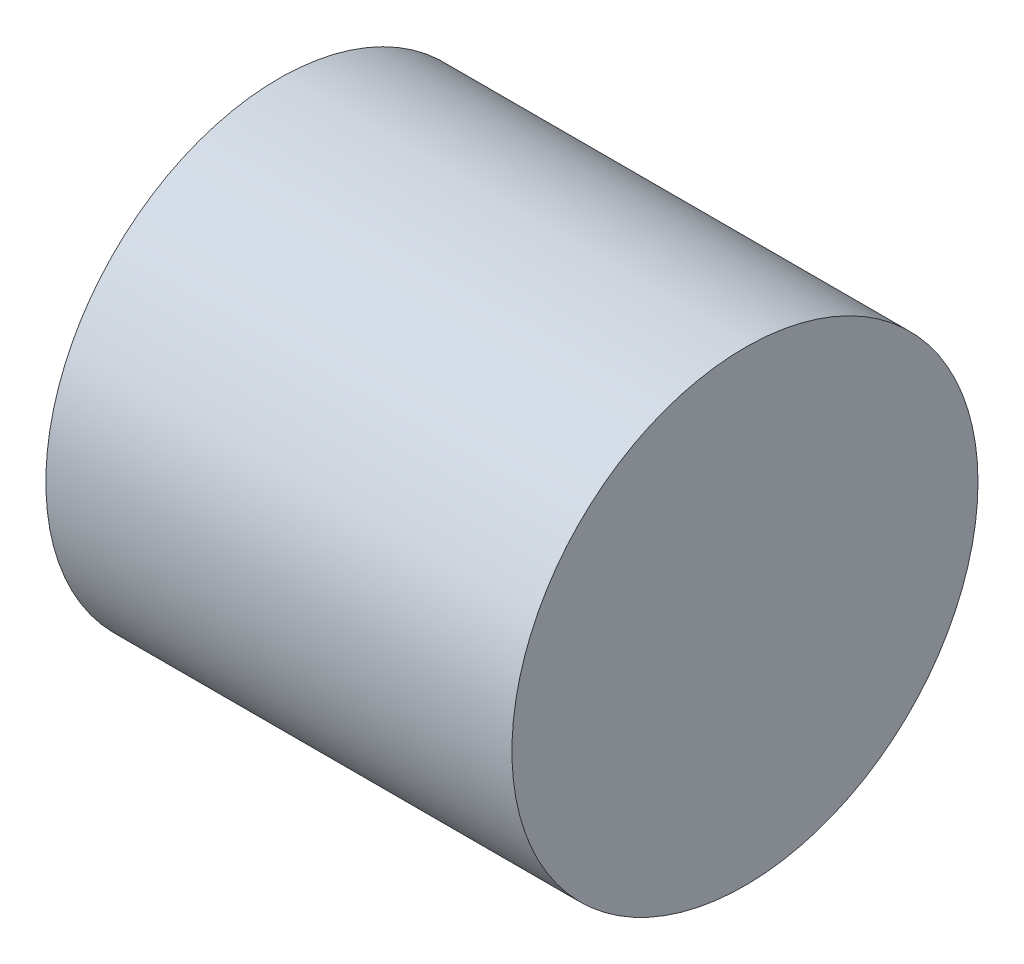
ISO-10303-21;
HEADER;
FILE_DESCRIPTION(('STEP AP214'),'2;1');
FILE_NAME('part.step','',(''),(''),'','','');
FILE_SCHEMA(('AUTOMOTIVE_DESIGN { 1 0 10303 214 1 1 1 1 }'));
ENDSEC;
DATA;
#1=APPLICATION_CONTEXT('core data for automotive mechanical design processes');
#2=APPLICATION_PROTOCOL_DEFINITION('international standard','automotive_design',2000,#1);
#3=PRODUCT_CONTEXT('',#1,'mechanical');
#4=PRODUCT('Part','Part','',(#3));
#5=PRODUCT_RELATED_PRODUCT_CATEGORY('part','',(#4));
#6=PRODUCT_DEFINITION_FORMATION('','',#4);
#7=PRODUCT_DEFINITION_CONTEXT('part definition',#1,'design');
#8=PRODUCT_DEFINITION('design','',#6,#7);
#9=PRODUCT_DEFINITION_SHAPE('','',#8);
#10=(LENGTH_UNIT() NAMED_UNIT(*) SI_UNIT(.MILLI.,.METRE.));
#11=(NAMED_UNIT(*) PLANE_ANGLE_UNIT() SI_UNIT($,.RADIAN.));
#12=(NAMED_UNIT(*) SI_UNIT($,.STERADIAN.) SOLID_ANGLE_UNIT());
#13=UNCERTAINTY_MEASURE_WITH_UNIT(LENGTH_MEASURE(1.E-05),#10,'distance_accuracy_value','');
#14=(GEOMETRIC_REPRESENTATION_CONTEXT(3) GLOBAL_UNCERTAINTY_ASSIGNED_CONTEXT((#13)) GLOBAL_UNIT_ASSIGNED_CONTEXT((#10,
#11,#12)) REPRESENTATION_CONTEXT('',''));
#15=CARTESIAN_POINT('',(0.,0.,0.));
#16=DIRECTION('',(0.,0.,1.));
#17=DIRECTION('',(1.,0.,0.));
#18=AXIS2_PLACEMENT_3D('',#15,#16,#17);
#19=CARTESIAN_POINT('',(40.,0.,0.));
#20=DIRECTION('',(-1.,0.,0.));
#21=DIRECTION('',(0.,0.,1.));
#22=AXIS2_PLACEMENT_3D('',#19,#20,#21);
#23=CYLINDRICAL_SURFACE('',#22,20.);
#24=CARTESIAN_POINT('',(40.,0.,0.));
#25=DIRECTION('',(1.,0.,0.));
#26=DIRECTION('',(0.,0.,-1.));
#27=AXIS2_PLACEMENT_3D('',#24,#25,#26);
#28=CIRCLE('',#27,20.);
#29=CARTESIAN_POINT('',(40.,0.,-20.));
#30=VERTEX_POINT('',#29);
#31=EDGE_CURVE('E10',#30,#30,#28,.T.);
#32=ORIENTED_EDGE('',*,*,#31,.F.);
#33=EDGE_LOOP('',(#32));
#34=FACE_BOUND('',#33,.T.);
#35=CARTESIAN_POINT('',(0.,0.,0.));
#36=DIRECTION('',(1.,0.,0.));
#37=DIRECTION('',(0.,0.,-1.));
#38=AXIS2_PLACEMENT_3D('',#35,#36,#37);
#39=CIRCLE('',#38,20.);
#40=CARTESIAN_POINT('',(0.,0.,-20.));
#41=VERTEX_POINT('',#40);
#42=EDGE_CURVE('E34',#41,#41,#39,.T.);
#43=ORIENTED_EDGE('',*,*,#42,.T.);
#44=EDGE_LOOP('',(#43));
#45=FACE_BOUND('',#44,.T.);
#46=ADVANCED_FACE('F31',(#34,#45),#23,.T.);
#47=CARTESIAN_POINT('',(40.,0.,0.));
#48=DIRECTION('',(1.,0.,0.));
#49=DIRECTION('',(0.,0.,-1.));
#50=AXIS2_PLACEMENT_3D('',#47,#48,#49);
#51=PLANE('',#50);
#52=ORIENTED_EDGE('',*,*,#31,.T.);
#53=EDGE_LOOP('',(#52));
#54=FACE_BOUND('',#53,.T.);
#55=ADVANCED_FACE('F60',(#54),#51,.T.);
#56=CARTESIAN_POINT('',(0.,0.,0.));
#57=DIRECTION('',(1.,0.,0.));
#58=DIRECTION('',(0.,0.,-1.));
#59=AXIS2_PLACEMENT_3D('',#56,#57,#58);
#60=PLANE('',#59);
#61=CARTESIAN_POINT('',(0.,0.,0.));
#62=DIRECTION('',(-1.,0.,0.));
#63=DIRECTION('',(0.,0.,1.));
#64=AXIS2_PLACEMENT_3D('',#61,#62,#63);
#65=CIRCLE('',#64,2.);
#66=CARTESIAN_POINT('',(0.,0.,2.));
#67=VERTEX_POINT('',#66);
#68=EDGE_CURVE('E43',#67,#67,#65,.T.);
#69=ORIENTED_EDGE('',*,*,#68,.F.);
#70=EDGE_LOOP('',(#69));
#71=FACE_BOUND('',#70,.T.);
#72=ORIENTED_EDGE('',*,*,#42,.F.);
#73=EDGE_LOOP('',(#72));
#74=FACE_BOUND('',#73,.T.);
#75=ADVANCED_FACE('F54',(#71,#74),#60,.F.);
#76=CARTESIAN_POINT('',(5.,0.,0.));
#77=DIRECTION('',(-1.,0.,0.));
#78=DIRECTION('',(0.,0.,1.));
#79=AXIS2_PLACEMENT_3D('',#76,#77,#78);
#80=CYLINDRICAL_SURFACE('',#79,2.);
#81=CARTESIAN_POINT('',(5.,0.,0.));
#82=DIRECTION('',(-1.,0.,0.));
#83=DIRECTION('',(0.,0.,1.));
#84=AXIS2_PLACEMENT_3D('',#81,#82,#83);
#85=CIRCLE('',#84,2.);
#86=CARTESIAN_POINT('',(5.,0.,2.));
#87=VERTEX_POINT('',#86);
#88=EDGE_CURVE('E41',#87,#87,#85,.T.);
#89=ORIENTED_EDGE('',*,*,#88,.F.);
#90=EDGE_LOOP('',(#89));
#91=FACE_BOUND('',#90,.T.);
#92=ORIENTED_EDGE('',*,*,#68,.T.);
#93=EDGE_LOOP('',(#92));
#94=FACE_BOUND('',#93,.T.);
#95=ADVANCED_FACE('F51',(#91,#94),#80,.F.);
#96=CARTESIAN_POINT('',(5.,0.,0.));
#97=DIRECTION('',(-1.,0.,0.));
#98=DIRECTION('',(0.,0.,1.));
#99=AXIS2_PLACEMENT_3D('',#96,#97,#98);
#100=PLANE('',#99);
#101=ORIENTED_EDGE('',*,*,#88,.T.);
#102=EDGE_LOOP('',(#101));
#103=FACE_BOUND('',#102,.T.);
#104=ADVANCED_FACE('F49',(#103),#100,.T.);
#105=CLOSED_SHELL('',(#46,#55,#75,#95,#104));
#106=MANIFOLD_SOLID_BREP('B2',#105);
#107=ADVANCED_BREP_SHAPE_REPRESENTATION('',(#18,#106),#14);
#108=SHAPE_DEFINITION_REPRESENTATION(#9,#107);
ENDSEC;
END-ISO-10303-21;
